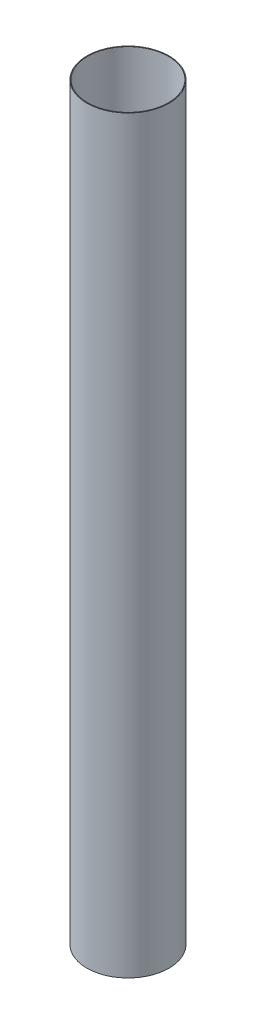
ISO-10303-21;
HEADER;
FILE_DESCRIPTION(('STEP AP214'),'2;1');
FILE_NAME('part.step','',(''),(''),'','','');
FILE_SCHEMA(('AUTOMOTIVE_DESIGN { 1 0 10303 214 1 1 1 1 }'));
ENDSEC;
DATA;
#1=APPLICATION_CONTEXT('core data for automotive mechanical design processes');
#2=APPLICATION_PROTOCOL_DEFINITION('international standard','automotive_design',2000,#1);
#3=PRODUCT_CONTEXT('',#1,'mechanical');
#4=PRODUCT('Part','Part','',(#3));
#5=PRODUCT_RELATED_PRODUCT_CATEGORY('part','',(#4));
#6=PRODUCT_DEFINITION_FORMATION('','',#4);
#7=PRODUCT_DEFINITION_CONTEXT('part definition',#1,'design');
#8=PRODUCT_DEFINITION('design','',#6,#7);
#9=PRODUCT_DEFINITION_SHAPE('','',#8);
#10=(LENGTH_UNIT() NAMED_UNIT(*) SI_UNIT(.MILLI.,.METRE.));
#11=(NAMED_UNIT(*) PLANE_ANGLE_UNIT() SI_UNIT($,.RADIAN.));
#12=(NAMED_UNIT(*) SI_UNIT($,.STERADIAN.) SOLID_ANGLE_UNIT());
#13=UNCERTAINTY_MEASURE_WITH_UNIT(LENGTH_MEASURE(1.E-05),#10,'distance_accuracy_value','');
#14=(GEOMETRIC_REPRESENTATION_CONTEXT(3) GLOBAL_UNCERTAINTY_ASSIGNED_CONTEXT((#13)) GLOBAL_UNIT_ASSIGNED_CONTEXT((#10,
#11,#12)) REPRESENTATION_CONTEXT('',''));
#15=CARTESIAN_POINT('',(0.,0.,0.));
#16=DIRECTION('',(0.,0.,1.));
#17=DIRECTION('',(1.,0.,0.));
#18=AXIS2_PLACEMENT_3D('',#15,#16,#17);
#19=CARTESIAN_POINT('',(0.,1651.,0.));
#20=DIRECTION('',(0.,1.,0.));
#21=DIRECTION('',(0.,0.,1.));
#22=AXIS2_PLACEMENT_3D('',#19,#20,#21);
#23=PLANE('',#22);
#24=CARTESIAN_POINT('',(0.,1651.,0.));
#25=DIRECTION('',(0.,1.,0.));
#26=DIRECTION('',(0.,0.,1.));
#27=AXIS2_PLACEMENT_3D('',#24,#25,#26);
#28=CIRCLE('',#27,90.4875);
#29=CARTESIAN_POINT('',(0.,1651.,90.4875));
#30=VERTEX_POINT('',#29);
#31=EDGE_CURVE('E10',#30,#30,#28,.T.);
#32=ORIENTED_EDGE('',*,*,#31,.T.);
#33=EDGE_LOOP('',(#32));
#34=FACE_BOUND('',#33,.T.);
#35=CARTESIAN_POINT('',(0.,1651.,0.));
#36=DIRECTION('',(0.,1.,0.));
#37=DIRECTION('',(0.,0.,1.));
#38=AXIS2_PLACEMENT_3D('',#35,#36,#37);
#39=CIRCLE('',#38,88.9);
#40=CARTESIAN_POINT('',(0.,1651.,88.9));
#41=VERTEX_POINT('',#40);
#42=EDGE_CURVE('E44',#41,#41,#39,.T.);
#43=ORIENTED_EDGE('',*,*,#42,.F.);
#44=EDGE_LOOP('',(#43));
#45=FACE_BOUND('',#44,.T.);
#46=ADVANCED_FACE('F33',(#34,#45),#23,.T.);
#47=CARTESIAN_POINT('',(0.,0.,0.));
#48=DIRECTION('',(0.,1.,0.));
#49=DIRECTION('',(0.,0.,1.));
#50=AXIS2_PLACEMENT_3D('',#47,#48,#49);
#51=PLANE('',#50);
#52=CARTESIAN_POINT('',(0.,0.,0.));
#53=DIRECTION('',(0.,1.,0.));
#54=DIRECTION('',(0.,0.,1.));
#55=AXIS2_PLACEMENT_3D('',#52,#53,#54);
#56=CIRCLE('',#55,90.4875);
#57=CARTESIAN_POINT('',(0.,0.,90.4875));
#58=VERTEX_POINT('',#57);
#59=EDGE_CURVE('E37',#58,#58,#56,.T.);
#60=ORIENTED_EDGE('',*,*,#59,.F.);
#61=EDGE_LOOP('',(#60));
#62=FACE_BOUND('',#61,.T.);
#63=CARTESIAN_POINT('',(0.,0.,0.));
#64=DIRECTION('',(0.,1.,0.));
#65=DIRECTION('',(0.,0.,1.));
#66=AXIS2_PLACEMENT_3D('',#63,#64,#65);
#67=CIRCLE('',#66,88.9);
#68=CARTESIAN_POINT('',(0.,0.,88.9));
#69=VERTEX_POINT('',#68);
#70=EDGE_CURVE('E46',#69,#69,#67,.T.);
#71=ORIENTED_EDGE('',*,*,#70,.T.);
#72=EDGE_LOOP('',(#71));
#73=FACE_BOUND('',#72,.T.);
#74=ADVANCED_FACE('F56',(#62,#73),#51,.F.);
#75=CARTESIAN_POINT('',(0.,1651.,0.));
#76=DIRECTION('',(0.,-1.,0.));
#77=DIRECTION('',(0.,0.,-1.));
#78=AXIS2_PLACEMENT_3D('',#75,#76,#77);
#79=CYLINDRICAL_SURFACE('',#78,90.4875);
#80=ORIENTED_EDGE('',*,*,#31,.F.);
#81=EDGE_LOOP('',(#80));
#82=FACE_BOUND('',#81,.T.);
#83=ORIENTED_EDGE('',*,*,#59,.T.);
#84=EDGE_LOOP('',(#83));
#85=FACE_BOUND('',#84,.T.);
#86=ADVANCED_FACE('F35',(#82,#85),#79,.T.);
#87=CARTESIAN_POINT('',(0.,1651.,0.));
#88=DIRECTION('',(0.,-1.,0.));
#89=DIRECTION('',(0.,0.,-1.));
#90=AXIS2_PLACEMENT_3D('',#87,#88,#89);
#91=CYLINDRICAL_SURFACE('',#90,88.9);
#92=ORIENTED_EDGE('',*,*,#42,.T.);
#93=EDGE_LOOP('',(#92));
#94=FACE_BOUND('',#93,.T.);
#95=ORIENTED_EDGE('',*,*,#70,.F.);
#96=EDGE_LOOP('',(#95));
#97=FACE_BOUND('',#96,.T.);
#98=ADVANCED_FACE('F52',(#94,#97),#91,.F.);
#99=CLOSED_SHELL('',(#46,#74,#86,#98));
#100=MANIFOLD_SOLID_BREP('B2',#99);
#101=ADVANCED_BREP_SHAPE_REPRESENTATION('',(#18,#100),#14);
#102=SHAPE_DEFINITION_REPRESENTATION(#9,#101);
ENDSEC;
END-ISO-10303-21;
